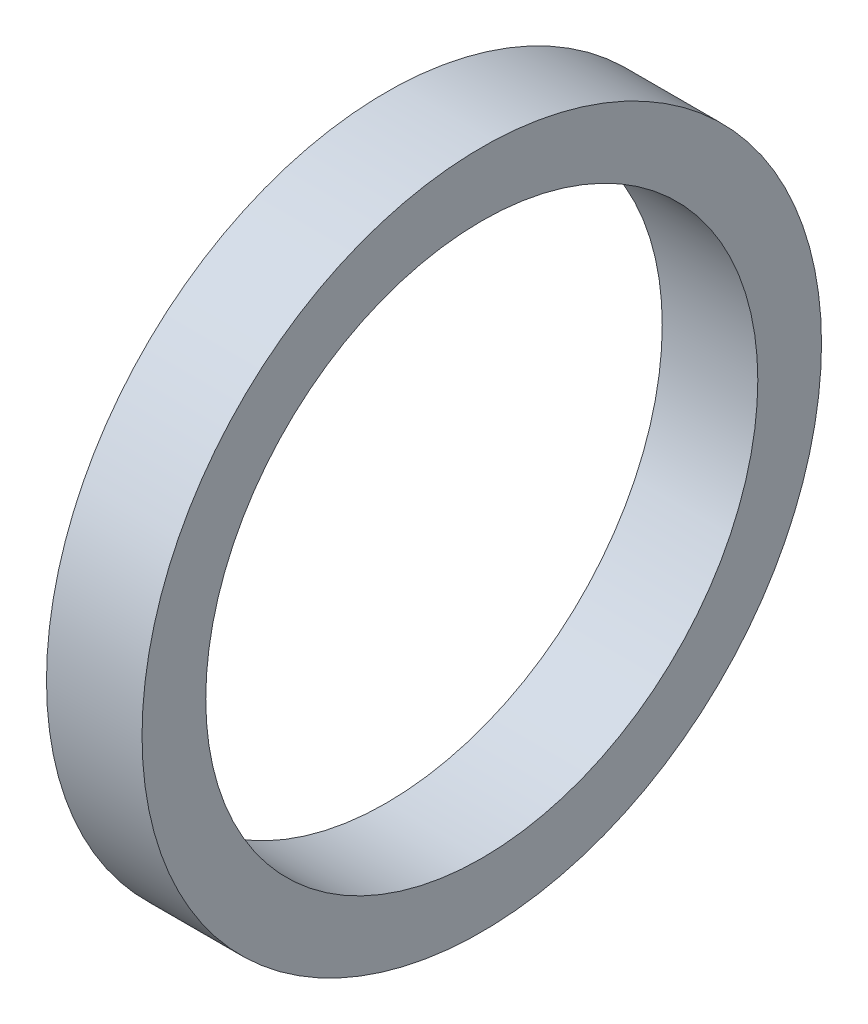
ISO-10303-21;
HEADER;
FILE_DESCRIPTION(('STEP AP214'),'2;1');
FILE_NAME('part.step','',(''),(''),'','','');
FILE_SCHEMA(('AUTOMOTIVE_DESIGN { 1 0 10303 214 1 1 1 1 }'));
ENDSEC;
DATA;
#1=APPLICATION_CONTEXT('core data for automotive mechanical design processes');
#2=APPLICATION_PROTOCOL_DEFINITION('international standard','automotive_design',2000,#1);
#3=PRODUCT_CONTEXT('',#1,'mechanical');
#4=PRODUCT('Part','Part','',(#3));
#5=PRODUCT_RELATED_PRODUCT_CATEGORY('part','',(#4));
#6=PRODUCT_DEFINITION_FORMATION('','',#4);
#7=PRODUCT_DEFINITION_CONTEXT('part definition',#1,'design');
#8=PRODUCT_DEFINITION('design','',#6,#7);
#9=PRODUCT_DEFINITION_SHAPE('','',#8);
#10=(LENGTH_UNIT() NAMED_UNIT(*) SI_UNIT(.MILLI.,.METRE.));
#11=(NAMED_UNIT(*) PLANE_ANGLE_UNIT() SI_UNIT($,.RADIAN.));
#12=(NAMED_UNIT(*) SI_UNIT($,.STERADIAN.) SOLID_ANGLE_UNIT());
#13=UNCERTAINTY_MEASURE_WITH_UNIT(LENGTH_MEASURE(1.E-05),#10,'distance_accuracy_value','');
#14=(GEOMETRIC_REPRESENTATION_CONTEXT(3) GLOBAL_UNCERTAINTY_ASSIGNED_CONTEXT((#13)) GLOBAL_UNIT_ASSIGNED_CONTEXT((#10,
#11,#12)) REPRESENTATION_CONTEXT('',''));
#15=CARTESIAN_POINT('',(0.,0.,0.));
#16=DIRECTION('',(0.,0.,1.));
#17=DIRECTION('',(1.,0.,0.));
#18=AXIS2_PLACEMENT_3D('',#15,#16,#17);
#19=CARTESIAN_POINT('',(344.109106581413,-658.084726668183,-2025.30462446028));
#20=DIRECTION('',(1.,0.,0.));
#21=DIRECTION('',(0.,0.,-1.));
#22=AXIS2_PLACEMENT_3D('',#19,#20,#21);
#23=PLANE('',#22);
#24=CARTESIAN_POINT('',(344.109106581413,-668.392503518098,-2033.22609758164));
#25=DIRECTION('',(-1.,0.,0.));
#26=DIRECTION('',(0.,0.,1.));
#27=AXIS2_PLACEMENT_3D('',#24,#25,#26);
#28=CIRCLE('',#27,13.0000000000002);
#29=CARTESIAN_POINT('',(344.109106581413,-668.392503518098,-2020.22609758164));
#30=VERTEX_POINT('',#29);
#31=EDGE_CURVE('E46',#30,#30,#28,.T.);
#32=ORIENTED_EDGE('',*,*,#31,.T.);
#33=EDGE_LOOP('',(#32));
#34=FACE_BOUND('',#33,.T.);
#35=CARTESIAN_POINT('',(344.109106581413,-668.392503518098,-2033.22609758164));
#36=DIRECTION('',(-1.,0.,0.));
#37=DIRECTION('',(0.,0.,1.));
#38=AXIS2_PLACEMENT_3D('',#35,#36,#37);
#39=CIRCLE('',#38,16.0000000000002);
#40=CARTESIAN_POINT('',(344.109106581413,-668.392503518098,-2017.22609758164));
#41=VERTEX_POINT('',#40);
#42=EDGE_CURVE('E10',#41,#41,#39,.T.);
#43=ORIENTED_EDGE('',*,*,#42,.F.);
#44=EDGE_LOOP('',(#43));
#45=FACE_BOUND('',#44,.T.);
#46=ADVANCED_FACE('F32',(#34,#45),#23,.T.);
#47=CARTESIAN_POINT('',(338.546606581413,-668.392503518098,-2033.22609758164));
#48=DIRECTION('',(-1.,0.,0.));
#49=DIRECTION('',(0.,0.,1.));
#50=AXIS2_PLACEMENT_3D('',#47,#48,#49);
#51=CYLINDRICAL_SURFACE('',#50,16.0000000000002);
#52=ORIENTED_EDGE('',*,*,#42,.T.);
#53=EDGE_LOOP('',(#52));
#54=FACE_BOUND('',#53,.T.);
#55=CARTESIAN_POINT('',(339.609106581413,-668.392503518098,-2033.22609758164));
#56=DIRECTION('',(-1.,0.,0.));
#57=DIRECTION('',(0.,0.,1.));
#58=AXIS2_PLACEMENT_3D('',#55,#56,#57);
#59=CIRCLE('',#58,16.0000000000002);
#60=CARTESIAN_POINT('',(339.609106581413,-668.392503518098,-2017.22609758164));
#61=VERTEX_POINT('',#60);
#62=EDGE_CURVE('E38',#61,#61,#59,.T.);
#63=ORIENTED_EDGE('',*,*,#62,.F.);
#64=EDGE_LOOP('',(#63));
#65=FACE_BOUND('',#64,.T.);
#66=ADVANCED_FACE('F62',(#54,#65),#51,.T.);
#67=CARTESIAN_POINT('',(339.609106581413,-658.084726668183,-2025.30462446028));
#68=DIRECTION('',(-1.,0.,0.));
#69=DIRECTION('',(0.,0.,1.));
#70=AXIS2_PLACEMENT_3D('',#67,#68,#69);
#71=PLANE('',#70);
#72=ORIENTED_EDGE('',*,*,#62,.T.);
#73=EDGE_LOOP('',(#72));
#74=FACE_BOUND('',#73,.T.);
#75=CARTESIAN_POINT('',(339.609106581413,-668.392503518098,-2033.22609758164));
#76=DIRECTION('',(-1.,0.,0.));
#77=DIRECTION('',(0.,0.,1.));
#78=AXIS2_PLACEMENT_3D('',#75,#76,#77);
#79=CIRCLE('',#78,13.0000000000002);
#80=CARTESIAN_POINT('',(339.609106581413,-668.392503518098,-2020.22609758164));
#81=VERTEX_POINT('',#80);
#82=EDGE_CURVE('E42',#81,#81,#79,.T.);
#83=ORIENTED_EDGE('',*,*,#82,.F.);
#84=EDGE_LOOP('',(#83));
#85=FACE_BOUND('',#84,.T.);
#86=ADVANCED_FACE('F56',(#74,#85),#71,.T.);
#87=CARTESIAN_POINT('',(338.546606581413,-668.392503518098,-2033.22609758164));
#88=DIRECTION('',(-1.,0.,0.));
#89=DIRECTION('',(0.,0.,1.));
#90=AXIS2_PLACEMENT_3D('',#87,#88,#89);
#91=CYLINDRICAL_SURFACE('',#90,13.0000000000002);
#92=ORIENTED_EDGE('',*,*,#82,.T.);
#93=EDGE_LOOP('',(#92));
#94=FACE_BOUND('',#93,.T.);
#95=ORIENTED_EDGE('',*,*,#31,.F.);
#96=EDGE_LOOP('',(#95));
#97=FACE_BOUND('',#96,.T.);
#98=ADVANCED_FACE('F54',(#94,#97),#91,.F.);
#99=CLOSED_SHELL('',(#46,#66,#86,#98));
#100=MANIFOLD_SOLID_BREP('B2',#99);
#101=ADVANCED_BREP_SHAPE_REPRESENTATION('',(#18,#100),#14);
#102=SHAPE_DEFINITION_REPRESENTATION(#9,#101);
ENDSEC;
END-ISO-10303-21;
